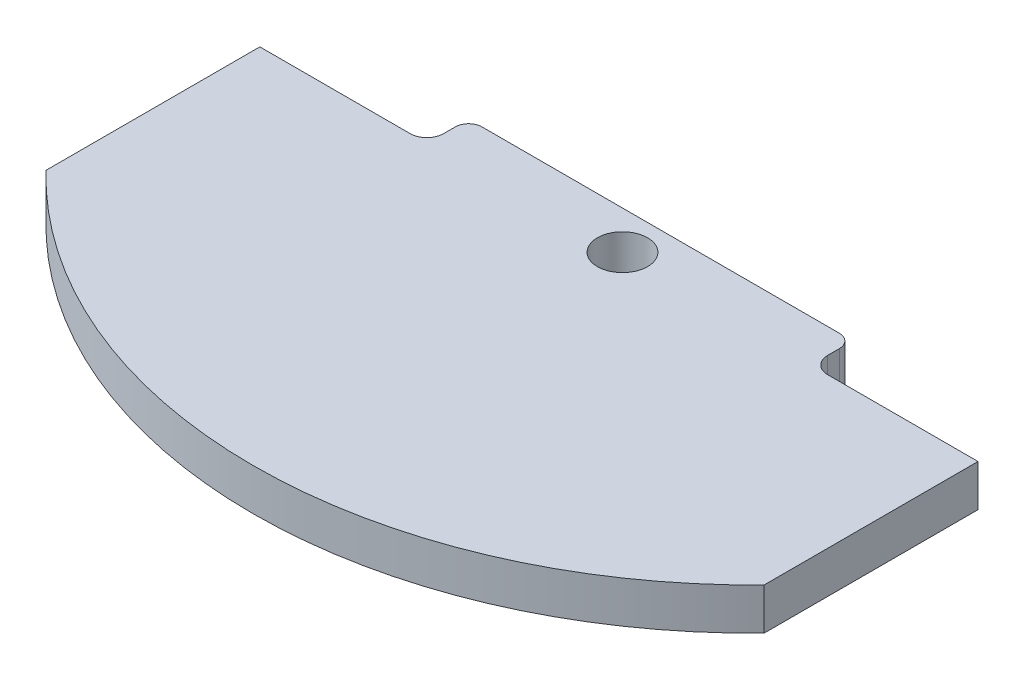
ISO-10303-21;
HEADER;
FILE_DESCRIPTION(('STEP AP214'),'2;1');
FILE_NAME('part.step','',(''),(''),'','','');
FILE_SCHEMA(('AUTOMOTIVE_DESIGN { 1 0 10303 214 1 1 1 1 }'));
ENDSEC;
DATA;
#1=APPLICATION_CONTEXT('core data for automotive mechanical design processes');
#2=APPLICATION_PROTOCOL_DEFINITION('international standard','automotive_design',2000,#1);
#3=PRODUCT_CONTEXT('',#1,'mechanical');
#4=PRODUCT('Part','Part','',(#3));
#5=PRODUCT_RELATED_PRODUCT_CATEGORY('part','',(#4));
#6=PRODUCT_DEFINITION_FORMATION('','',#4);
#7=PRODUCT_DEFINITION_CONTEXT('part definition',#1,'design');
#8=PRODUCT_DEFINITION('design','',#6,#7);
#9=PRODUCT_DEFINITION_SHAPE('','',#8);
#10=(LENGTH_UNIT() NAMED_UNIT(*) SI_UNIT(.MILLI.,.METRE.));
#11=(NAMED_UNIT(*) PLANE_ANGLE_UNIT() SI_UNIT($,.RADIAN.));
#12=(NAMED_UNIT(*) SI_UNIT($,.STERADIAN.) SOLID_ANGLE_UNIT());
#13=UNCERTAINTY_MEASURE_WITH_UNIT(LENGTH_MEASURE(1.E-05),#10,'distance_accuracy_value','');
#14=(GEOMETRIC_REPRESENTATION_CONTEXT(3) GLOBAL_UNCERTAINTY_ASSIGNED_CONTEXT((#13)) GLOBAL_UNIT_ASSIGNED_CONTEXT((#10,
#11,#12)) REPRESENTATION_CONTEXT('',''));
#15=CARTESIAN_POINT('',(0.,0.,0.));
#16=DIRECTION('',(0.,0.,1.));
#17=DIRECTION('',(1.,0.,0.));
#18=AXIS2_PLACEMENT_3D('',#15,#16,#17);
#19=CARTESIAN_POINT('',(0.,6.35,0.));
#20=DIRECTION('',(1.,0.,0.));
#21=DIRECTION('',(0.,0.,-1.));
#22=AXIS2_PLACEMENT_3D('',#19,#20,#21);
#23=PLANE('',#22);
#24=DIRECTION('',(0.,0.,1.));
#25=VECTOR('',#24,1.);
#26=CARTESIAN_POINT('',(0.,6.35,0.));
#27=LINE('',#26,#25);
#28=CARTESIAN_POINT('',(0.,6.35,6.35));
#29=VERTEX_POINT('',#28);
#30=CARTESIAN_POINT('',(0.,6.35,38.862));
#31=VERTEX_POINT('',#30);
#32=EDGE_CURVE('E146',#29,#31,#27,.T.);
#33=ORIENTED_EDGE('',*,*,#32,.F.);
#34=DIRECTION('',(0.,1.,0.));
#35=VECTOR('',#34,1.);
#36=CARTESIAN_POINT('',(0.,0.,6.35));
#37=LINE('',#36,#35);
#38=CARTESIAN_POINT('',(0.,0.,6.35));
#39=VERTEX_POINT('',#38);
#40=EDGE_CURVE('E132',#39,#29,#37,.T.);
#41=ORIENTED_EDGE('',*,*,#40,.F.);
#42=DIRECTION('',(0.,0.,1.));
#43=VECTOR('',#42,1.);
#44=CARTESIAN_POINT('',(0.,0.,0.));
#45=LINE('',#44,#43);
#46=CARTESIAN_POINT('',(0.,0.,38.862));
#47=VERTEX_POINT('',#46);
#48=EDGE_CURVE('E144',#39,#47,#45,.T.);
#49=ORIENTED_EDGE('',*,*,#48,.T.);
#50=DIRECTION('',(0.,-1.,0.));
#51=VECTOR('',#50,1.);
#52=CARTESIAN_POINT('',(0.,6.35,38.862));
#53=LINE('',#52,#51);
#54=EDGE_CURVE('E166',#31,#47,#53,.T.);
#55=ORIENTED_EDGE('',*,*,#54,.F.);
#56=EDGE_LOOP('',(#33,#41,#49,#55));
#57=FACE_BOUND('',#56,.T.);
#58=ADVANCED_FACE('F39',(#57),#23,.F.);
#59=CARTESIAN_POINT('',(54.5973,6.35,-14.0070347245909));
#60=DIRECTION('',(0.,-1.,0.));
#61=DIRECTION('',(0.,0.,-1.));
#62=AXIS2_PLACEMENT_3D('',#59,#60,#61);
#63=CYLINDRICAL_SURFACE('',#62,76.);
#64=CARTESIAN_POINT('',(54.5973,0.,-14.0070347245909));
#65=DIRECTION('',(0.,1.,0.));
#66=DIRECTION('',(0.,0.,-1.));
#67=AXIS2_PLACEMENT_3D('',#64,#65,#66);
#68=CIRCLE('',#67,76.);
#69=CARTESIAN_POINT('',(109.1946,0.,38.862));
#70=VERTEX_POINT('',#69);
#71=EDGE_CURVE('E150',#47,#70,#68,.T.);
#72=ORIENTED_EDGE('',*,*,#71,.T.);
#73=DIRECTION('',(0.,-1.,0.));
#74=VECTOR('',#73,1.);
#75=CARTESIAN_POINT('',(109.1946,6.35,38.862));
#76=LINE('',#75,#74);
#77=CARTESIAN_POINT('',(109.1946,6.35,38.862));
#78=VERTEX_POINT('',#77);
#79=EDGE_CURVE('E163',#78,#70,#76,.T.);
#80=ORIENTED_EDGE('',*,*,#79,.F.);
#81=CARTESIAN_POINT('',(54.5973,6.35,-14.0070347245909));
#82=DIRECTION('',(0.,1.,0.));
#83=DIRECTION('',(0.,0.,-1.));
#84=AXIS2_PLACEMENT_3D('',#81,#82,#83);
#85=CIRCLE('',#84,76.);
#86=EDGE_CURVE('E224',#31,#78,#85,.T.);
#87=ORIENTED_EDGE('',*,*,#86,.F.);
#88=ORIENTED_EDGE('',*,*,#54,.T.);
#89=EDGE_LOOP('',(#72,#80,#87,#88));
#90=FACE_BOUND('',#89,.T.);
#91=ADVANCED_FACE('F266',(#90),#63,.T.);
#92=CARTESIAN_POINT('',(109.1946,6.35,0.));
#93=DIRECTION('',(-1.,0.,0.));
#94=DIRECTION('',(0.,0.,1.));
#95=AXIS2_PLACEMENT_3D('',#92,#93,#94);
#96=PLANE('',#95);
#97=DIRECTION('',(0.,0.,-1.));
#98=VECTOR('',#97,1.);
#99=CARTESIAN_POINT('',(109.1946,0.,0.));
#100=LINE('',#99,#98);
#101=CARTESIAN_POINT('',(109.1946,0.,6.34999999999999));
#102=VERTEX_POINT('',#101);
#103=EDGE_CURVE('E153',#70,#102,#100,.T.);
#104=ORIENTED_EDGE('',*,*,#103,.T.);
#105=DIRECTION('',(0.,1.,0.));
#106=VECTOR('',#105,1.);
#107=CARTESIAN_POINT('',(109.1946,0.,6.34999999999999));
#108=LINE('',#107,#106);
#109=CARTESIAN_POINT('',(109.1946,6.35,6.34999999999999));
#110=VERTEX_POINT('',#109);
#111=EDGE_CURVE('E231',#102,#110,#108,.T.);
#112=ORIENTED_EDGE('',*,*,#111,.T.);
#113=DIRECTION('',(0.,0.,-1.));
#114=VECTOR('',#113,1.);
#115=CARTESIAN_POINT('',(109.1946,6.35,0.));
#116=LINE('',#115,#114);
#117=EDGE_CURVE('E222',#78,#110,#116,.T.);
#118=ORIENTED_EDGE('',*,*,#117,.F.);
#119=ORIENTED_EDGE('',*,*,#79,.T.);
#120=EDGE_LOOP('',(#104,#112,#118,#119));
#121=FACE_BOUND('',#120,.T.);
#122=ADVANCED_FACE('F272',(#121),#96,.F.);
#123=CARTESIAN_POINT('',(0.,6.35,0.));
#124=DIRECTION('',(0.,0.,1.));
#125=DIRECTION('',(1.,0.,0.));
#126=AXIS2_PLACEMENT_3D('',#123,#124,#125);
#127=PLANE('',#126);
#128=DIRECTION('',(-1.,0.,0.));
#129=VECTOR('',#128,1.);
#130=CARTESIAN_POINT('',(0.,6.35,0.));
#131=LINE('',#130,#129);
#132=CARTESIAN_POINT('',(81.7626,6.35,0.));
#133=VERTEX_POINT('',#132);
#134=CARTESIAN_POINT('',(27.432,6.35,0.));
#135=VERTEX_POINT('',#134);
#136=EDGE_CURVE('E156',#133,#135,#131,.T.);
#137=ORIENTED_EDGE('',*,*,#136,.F.);
#138=DIRECTION('',(0.,1.,0.));
#139=VECTOR('',#138,1.);
#140=CARTESIAN_POINT('',(81.7626,6.35,0.));
#141=LINE('',#140,#139);
#142=CARTESIAN_POINT('',(81.7626,0.,0.));
#143=VERTEX_POINT('',#142);
#144=EDGE_CURVE('E197',#133,#143,#141,.F.);
#145=ORIENTED_EDGE('',*,*,#144,.T.);
#146=DIRECTION('',(-1.,0.,0.));
#147=VECTOR('',#146,1.);
#148=CARTESIAN_POINT('',(0.,0.,0.));
#149=LINE('',#148,#147);
#150=CARTESIAN_POINT('',(27.432,0.,0.));
#151=VERTEX_POINT('',#150);
#152=EDGE_CURVE('E161',#143,#151,#149,.T.);
#153=ORIENTED_EDGE('',*,*,#152,.T.);
#154=DIRECTION('',(0.,1.,0.));
#155=VECTOR('',#154,1.);
#156=CARTESIAN_POINT('',(27.432,6.35,0.));
#157=LINE('',#156,#155);
#158=EDGE_CURVE('E194',#151,#135,#157,.T.);
#159=ORIENTED_EDGE('',*,*,#158,.T.);
#160=EDGE_LOOP('',(#137,#145,#153,#159));
#161=FACE_BOUND('',#160,.T.);
#162=ADVANCED_FACE('F220',(#161),#127,.F.);
#163=CARTESIAN_POINT('',(54.5973,6.35,-14.0070347245909));
#164=DIRECTION('',(0.,-1.,0.));
#165=DIRECTION('',(0.,0.,-1.));
#166=AXIS2_PLACEMENT_3D('',#163,#164,#165);
#167=PLANE('',#166);
#168=CARTESIAN_POINT('',(54.61,6.35,5.81937520300735));
#169=DIRECTION('',(0.,-1.,0.));
#170=DIRECTION('',(0.,0.,-1.));
#171=AXIS2_PLACEMENT_3D('',#168,#169,#170);
#172=CIRCLE('',#171,3.81);
#173=CARTESIAN_POINT('',(54.61,6.35,2.00937520300735));
#174=VERTEX_POINT('',#173);
#175=EDGE_CURVE('E236',#174,#174,#172,.T.);
#176=ORIENTED_EDGE('',*,*,#175,.T.);
#177=EDGE_LOOP('',(#176));
#178=FACE_BOUND('',#177,.T.);
#179=DIRECTION('',(0.,0.,1.));
#180=VECTOR('',#179,1.);
#181=CARTESIAN_POINT('',(83.7946,6.35,0.));
#182=LINE('',#181,#180);
#183=CARTESIAN_POINT('',(83.7946,6.35,2.032));
#184=VERTEX_POINT('',#183);
#185=CARTESIAN_POINT('',(83.7946,6.35,3.80999999999999));
#186=VERTEX_POINT('',#185);
#187=EDGE_CURVE('E218',#184,#186,#182,.T.);
#188=ORIENTED_EDGE('',*,*,#187,.F.);
#189=CARTESIAN_POINT('',(81.7626,6.35,2.032));
#190=DIRECTION('',(0.,-1.,0.));
#191=DIRECTION('',(0.,0.,-1.));
#192=AXIS2_PLACEMENT_3D('',#189,#190,#191);
#193=CIRCLE('',#192,2.032);
#194=EDGE_CURVE('E192',#184,#133,#193,.F.);
#195=ORIENTED_EDGE('',*,*,#194,.T.);
#196=ORIENTED_EDGE('',*,*,#136,.T.);
#197=CARTESIAN_POINT('',(27.432,6.35,2.032));
#198=DIRECTION('',(0.,-1.,0.));
#199=DIRECTION('',(0.,0.,-1.));
#200=AXIS2_PLACEMENT_3D('',#197,#198,#199);
#201=CIRCLE('',#200,2.032);
#202=CARTESIAN_POINT('',(25.4,6.35,2.032));
#203=VERTEX_POINT('',#202);
#204=EDGE_CURVE('E190',#135,#203,#201,.F.);
#205=ORIENTED_EDGE('',*,*,#204,.T.);
#206=DIRECTION('',(0.,0.,-1.));
#207=VECTOR('',#206,1.);
#208=CARTESIAN_POINT('',(25.4,6.35,0.));
#209=LINE('',#208,#207);
#210=CARTESIAN_POINT('',(25.4,6.35,3.81));
#211=VERTEX_POINT('',#210);
#212=EDGE_CURVE('E139',#211,#203,#209,.T.);
#213=ORIENTED_EDGE('',*,*,#212,.F.);
#214=CARTESIAN_POINT('',(22.86,6.35,3.81));
#215=DIRECTION('',(0.,-1.,0.));
#216=DIRECTION('',(0.,0.,-1.));
#217=AXIS2_PLACEMENT_3D('',#214,#215,#216);
#218=CIRCLE('',#217,2.54);
#219=CARTESIAN_POINT('',(22.86,6.35,6.35));
#220=VERTEX_POINT('',#219);
#221=EDGE_CURVE('E183',#211,#220,#218,.T.);
#222=ORIENTED_EDGE('',*,*,#221,.T.);
#223=DIRECTION('',(1.,0.,0.));
#224=VECTOR('',#223,1.);
#225=CARTESIAN_POINT('',(0.,6.35,6.35));
#226=LINE('',#225,#224);
#227=EDGE_CURVE('E233',#29,#220,#226,.T.);
#228=ORIENTED_EDGE('',*,*,#227,.F.);
#229=ORIENTED_EDGE('',*,*,#32,.T.);
#230=ORIENTED_EDGE('',*,*,#86,.T.);
#231=ORIENTED_EDGE('',*,*,#117,.T.);
#232=DIRECTION('',(1.,0.,0.));
#233=VECTOR('',#232,1.);
#234=CARTESIAN_POINT('',(109.1946,6.35,6.34999999999999));
#235=LINE('',#234,#233);
#236=CARTESIAN_POINT('',(86.3346,6.35,6.34999999999999));
#237=VERTEX_POINT('',#236);
#238=EDGE_CURVE('E210',#237,#110,#235,.T.);
#239=ORIENTED_EDGE('',*,*,#238,.F.);
#240=CARTESIAN_POINT('',(86.3346,6.35,3.80999999999999));
#241=DIRECTION('',(0.,-1.,0.));
#242=DIRECTION('',(0.,0.,-1.));
#243=AXIS2_PLACEMENT_3D('',#240,#241,#242);
#244=CIRCLE('',#243,2.54);
#245=EDGE_CURVE('E178',#237,#186,#244,.T.);
#246=ORIENTED_EDGE('',*,*,#245,.T.);
#247=EDGE_LOOP('',(#188,#195,#196,#205,#213,#222,#228,#229,#230,#231,#239,#246));
#248=FACE_BOUND('',#247,.T.);
#249=ADVANCED_FACE('F217',(#178,#248),#167,.F.);
#250=CARTESIAN_POINT('',(54.5973,0.,-14.0070347245909));
#251=DIRECTION('',(0.,-1.,0.));
#252=DIRECTION('',(0.,0.,-1.));
#253=AXIS2_PLACEMENT_3D('',#250,#251,#252);
#254=PLANE('',#253);
#255=CARTESIAN_POINT('',(54.61,0.,5.81937520300735));
#256=DIRECTION('',(0.,-1.,0.));
#257=DIRECTION('',(0.,0.,-1.));
#258=AXIS2_PLACEMENT_3D('',#255,#256,#257);
#259=CIRCLE('',#258,3.81);
#260=CARTESIAN_POINT('',(54.61,0.,2.00937520300735));
#261=VERTEX_POINT('',#260);
#262=EDGE_CURVE('E241',#261,#261,#259,.T.);
#263=ORIENTED_EDGE('',*,*,#262,.F.);
#264=EDGE_LOOP('',(#263));
#265=FACE_BOUND('',#264,.T.);
#266=ORIENTED_EDGE('',*,*,#152,.F.);
#267=CARTESIAN_POINT('',(81.7626,0.,2.032));
#268=DIRECTION('',(0.,-1.,0.));
#269=DIRECTION('',(0.,0.,-1.));
#270=AXIS2_PLACEMENT_3D('',#267,#268,#269);
#271=CIRCLE('',#270,2.032);
#272=CARTESIAN_POINT('',(83.7946,0.,2.032));
#273=VERTEX_POINT('',#272);
#274=EDGE_CURVE('E47',#143,#273,#271,.T.);
#275=ORIENTED_EDGE('',*,*,#274,.T.);
#276=DIRECTION('',(0.,0.,1.));
#277=VECTOR('',#276,1.);
#278=CARTESIAN_POINT('',(83.7946,0.,0.));
#279=LINE('',#278,#277);
#280=CARTESIAN_POINT('',(83.7946,0.,3.80999999999999));
#281=VERTEX_POINT('',#280);
#282=EDGE_CURVE('E201',#273,#281,#279,.T.);
#283=ORIENTED_EDGE('',*,*,#282,.T.);
#284=CARTESIAN_POINT('',(86.3346,0.,3.80999999999999));
#285=DIRECTION('',(0.,-1.,0.));
#286=DIRECTION('',(0.,0.,-1.));
#287=AXIS2_PLACEMENT_3D('',#284,#285,#286);
#288=CIRCLE('',#287,2.54);
#289=CARTESIAN_POINT('',(86.3346,0.,6.34999999999999));
#290=VERTEX_POINT('',#289);
#291=EDGE_CURVE('E181',#281,#290,#288,.F.);
#292=ORIENTED_EDGE('',*,*,#291,.T.);
#293=DIRECTION('',(1.,0.,0.));
#294=VECTOR('',#293,1.);
#295=CARTESIAN_POINT('',(109.1946,0.,6.34999999999999));
#296=LINE('',#295,#294);
#297=EDGE_CURVE('E211',#290,#102,#296,.T.);
#298=ORIENTED_EDGE('',*,*,#297,.T.);
#299=ORIENTED_EDGE('',*,*,#103,.F.);
#300=ORIENTED_EDGE('',*,*,#71,.F.);
#301=ORIENTED_EDGE('',*,*,#48,.F.);
#302=DIRECTION('',(1.,0.,0.));
#303=VECTOR('',#302,1.);
#304=CARTESIAN_POINT('',(0.,0.,6.35));
#305=LINE('',#304,#303);
#306=CARTESIAN_POINT('',(22.86,0.,6.35));
#307=VERTEX_POINT('',#306);
#308=EDGE_CURVE('E128',#39,#307,#305,.T.);
#309=ORIENTED_EDGE('',*,*,#308,.T.);
#310=CARTESIAN_POINT('',(22.86,0.,3.81));
#311=DIRECTION('',(0.,-1.,0.));
#312=DIRECTION('',(0.,0.,-1.));
#313=AXIS2_PLACEMENT_3D('',#310,#311,#312);
#314=CIRCLE('',#313,2.54);
#315=CARTESIAN_POINT('',(25.4,0.,3.81));
#316=VERTEX_POINT('',#315);
#317=EDGE_CURVE('E185',#307,#316,#314,.F.);
#318=ORIENTED_EDGE('',*,*,#317,.T.);
#319=DIRECTION('',(0.,0.,-1.));
#320=VECTOR('',#319,1.);
#321=CARTESIAN_POINT('',(25.4,0.,0.));
#322=LINE('',#321,#320);
#323=CARTESIAN_POINT('',(25.4,0.,2.032));
#324=VERTEX_POINT('',#323);
#325=EDGE_CURVE('E138',#316,#324,#322,.T.);
#326=ORIENTED_EDGE('',*,*,#325,.T.);
#327=CARTESIAN_POINT('',(27.432,0.,2.032));
#328=DIRECTION('',(0.,-1.,0.));
#329=DIRECTION('',(0.,0.,-1.));
#330=AXIS2_PLACEMENT_3D('',#327,#328,#329);
#331=CIRCLE('',#330,2.032);
#332=EDGE_CURVE('E59',#324,#151,#331,.T.);
#333=ORIENTED_EDGE('',*,*,#332,.T.);
#334=EDGE_LOOP('',(#266,#275,#283,#292,#298,#299,#300,#301,#309,#318,#326,#333));
#335=FACE_BOUND('',#334,.T.);
#336=ADVANCED_FACE('F148',(#265,#335),#254,.T.);
#337=CARTESIAN_POINT('',(109.1946,0.,6.34999999999999));
#338=DIRECTION('',(0.,0.,1.));
#339=DIRECTION('',(1.,0.,0.));
#340=AXIS2_PLACEMENT_3D('',#337,#338,#339);
#341=PLANE('',#340);
#342=ORIENTED_EDGE('',*,*,#297,.F.);
#343=DIRECTION('',(0.,1.,0.));
#344=VECTOR('',#343,1.);
#345=CARTESIAN_POINT('',(86.3346,6.35,6.34999999999999));
#346=LINE('',#345,#344);
#347=EDGE_CURVE('E168',#290,#237,#346,.T.);
#348=ORIENTED_EDGE('',*,*,#347,.T.);
#349=ORIENTED_EDGE('',*,*,#238,.T.);
#350=ORIENTED_EDGE('',*,*,#111,.F.);
#351=EDGE_LOOP('',(#342,#348,#349,#350));
#352=FACE_BOUND('',#351,.T.);
#353=ADVANCED_FACE('F255',(#352),#341,.F.);
#354=CARTESIAN_POINT('',(83.7946,0.,0.));
#355=DIRECTION('',(-1.,0.,0.));
#356=DIRECTION('',(0.,0.,1.));
#357=AXIS2_PLACEMENT_3D('',#354,#355,#356);
#358=PLANE('',#357);
#359=ORIENTED_EDGE('',*,*,#282,.F.);
#360=DIRECTION('',(0.,1.,0.));
#361=VECTOR('',#360,1.);
#362=CARTESIAN_POINT('',(83.7946,0.,2.032));
#363=LINE('',#362,#361);
#364=EDGE_CURVE('E187',#273,#184,#363,.T.);
#365=ORIENTED_EDGE('',*,*,#364,.T.);
#366=ORIENTED_EDGE('',*,*,#187,.T.);
#367=DIRECTION('',(0.,1.,0.));
#368=VECTOR('',#367,1.);
#369=CARTESIAN_POINT('',(83.7946,0.,3.80999999999999));
#370=LINE('',#369,#368);
#371=EDGE_CURVE('E171',#186,#281,#370,.F.);
#372=ORIENTED_EDGE('',*,*,#371,.T.);
#373=EDGE_LOOP('',(#359,#365,#366,#372));
#374=FACE_BOUND('',#373,.T.);
#375=ADVANCED_FACE('F206',(#374),#358,.F.);
#376=CARTESIAN_POINT('',(25.4,0.,0.));
#377=DIRECTION('',(1.,0.,0.));
#378=DIRECTION('',(0.,0.,-1.));
#379=AXIS2_PLACEMENT_3D('',#376,#377,#378);
#380=PLANE('',#379);
#381=ORIENTED_EDGE('',*,*,#212,.T.);
#382=DIRECTION('',(0.,1.,0.));
#383=VECTOR('',#382,1.);
#384=CARTESIAN_POINT('',(25.4,0.,2.032));
#385=LINE('',#384,#383);
#386=EDGE_CURVE('E11',#203,#324,#385,.F.);
#387=ORIENTED_EDGE('',*,*,#386,.T.);
#388=ORIENTED_EDGE('',*,*,#325,.F.);
#389=DIRECTION('',(0.,1.,0.));
#390=VECTOR('',#389,1.);
#391=CARTESIAN_POINT('',(25.4,6.35,3.81));
#392=LINE('',#391,#390);
#393=EDGE_CURVE('E174',#316,#211,#392,.T.);
#394=ORIENTED_EDGE('',*,*,#393,.T.);
#395=EDGE_LOOP('',(#381,#387,#388,#394));
#396=FACE_BOUND('',#395,.T.);
#397=ADVANCED_FACE('F293',(#396),#380,.F.);
#398=CARTESIAN_POINT('',(0.,0.,6.35));
#399=DIRECTION('',(0.,0.,1.));
#400=DIRECTION('',(1.,0.,0.));
#401=AXIS2_PLACEMENT_3D('',#398,#399,#400);
#402=PLANE('',#401);
#403=ORIENTED_EDGE('',*,*,#227,.T.);
#404=DIRECTION('',(0.,1.,0.));
#405=VECTOR('',#404,1.);
#406=CARTESIAN_POINT('',(22.86,0.,6.35));
#407=LINE('',#406,#405);
#408=EDGE_CURVE('E135',#220,#307,#407,.F.);
#409=ORIENTED_EDGE('',*,*,#408,.T.);
#410=ORIENTED_EDGE('',*,*,#308,.F.);
#411=ORIENTED_EDGE('',*,*,#40,.T.);
#412=EDGE_LOOP('',(#403,#409,#410,#411));
#413=FACE_BOUND('',#412,.T.);
#414=ADVANCED_FACE('F131',(#413),#402,.F.);
#415=CARTESIAN_POINT('',(86.3346,0.,3.80999999999999));
#416=DIRECTION('',(0.,-1.,0.));
#417=DIRECTION('',(0.,0.,-1.));
#418=AXIS2_PLACEMENT_3D('',#415,#416,#417);
#419=CYLINDRICAL_SURFACE('',#418,2.54);
#420=ORIENTED_EDGE('',*,*,#291,.F.);
#421=ORIENTED_EDGE('',*,*,#371,.F.);
#422=ORIENTED_EDGE('',*,*,#245,.F.);
#423=ORIENTED_EDGE('',*,*,#347,.F.);
#424=EDGE_LOOP('',(#420,#421,#422,#423));
#425=FACE_BOUND('',#424,.T.);
#426=ADVANCED_FACE('F277',(#425),#419,.F.);
#427=CARTESIAN_POINT('',(22.86,0.,3.81));
#428=DIRECTION('',(0.,-1.,0.));
#429=DIRECTION('',(0.,0.,-1.));
#430=AXIS2_PLACEMENT_3D('',#427,#428,#429);
#431=CYLINDRICAL_SURFACE('',#430,2.54);
#432=ORIENTED_EDGE('',*,*,#317,.F.);
#433=ORIENTED_EDGE('',*,*,#408,.F.);
#434=ORIENTED_EDGE('',*,*,#221,.F.);
#435=ORIENTED_EDGE('',*,*,#393,.F.);
#436=EDGE_LOOP('',(#432,#433,#434,#435));
#437=FACE_BOUND('',#436,.T.);
#438=ADVANCED_FACE('F280',(#437),#431,.F.);
#439=CARTESIAN_POINT('',(81.7626,0.,2.032));
#440=DIRECTION('',(0.,1.,0.));
#441=DIRECTION('',(0.,0.,1.));
#442=AXIS2_PLACEMENT_3D('',#439,#440,#441);
#443=CYLINDRICAL_SURFACE('',#442,2.032);
#444=ORIENTED_EDGE('',*,*,#274,.F.);
#445=ORIENTED_EDGE('',*,*,#144,.F.);
#446=ORIENTED_EDGE('',*,*,#194,.F.);
#447=ORIENTED_EDGE('',*,*,#364,.F.);
#448=EDGE_LOOP('',(#444,#445,#446,#447));
#449=FACE_BOUND('',#448,.T.);
#450=ADVANCED_FACE('F213',(#449),#443,.T.);
#451=CARTESIAN_POINT('',(27.432,6.35,2.032));
#452=DIRECTION('',(0.,1.,0.));
#453=DIRECTION('',(0.,0.,1.));
#454=AXIS2_PLACEMENT_3D('',#451,#452,#453);
#455=CYLINDRICAL_SURFACE('',#454,2.032);
#456=ORIENTED_EDGE('',*,*,#332,.F.);
#457=ORIENTED_EDGE('',*,*,#386,.F.);
#458=ORIENTED_EDGE('',*,*,#204,.F.);
#459=ORIENTED_EDGE('',*,*,#158,.F.);
#460=EDGE_LOOP('',(#456,#457,#458,#459));
#461=FACE_BOUND('',#460,.T.);
#462=ADVANCED_FACE('F41',(#461),#455,.T.);
#463=CARTESIAN_POINT('',(54.61,6.35,5.81937520300735));
#464=DIRECTION('',(0.,-1.,0.));
#465=DIRECTION('',(0.,0.,-1.));
#466=AXIS2_PLACEMENT_3D('',#463,#464,#465);
#467=CYLINDRICAL_SURFACE('',#466,3.81);
#468=ORIENTED_EDGE('',*,*,#175,.F.);
#469=EDGE_LOOP('',(#468));
#470=FACE_BOUND('',#469,.T.);
#471=ORIENTED_EDGE('',*,*,#262,.T.);
#472=EDGE_LOOP('',(#471));
#473=FACE_BOUND('',#472,.T.);
#474=ADVANCED_FACE('F248',(#470,#473),#467,.F.);
#475=CLOSED_SHELL('',(#58,#91,#122,#162,#249,#336,#353,#375,#397,#414,#426,#438,#450,#462,#474));
#476=MANIFOLD_SOLID_BREP('B2',#475);
#477=ADVANCED_BREP_SHAPE_REPRESENTATION('',(#18,#476),#14);
#478=SHAPE_DEFINITION_REPRESENTATION(#9,#477);
ENDSEC;
END-ISO-10303-21;
